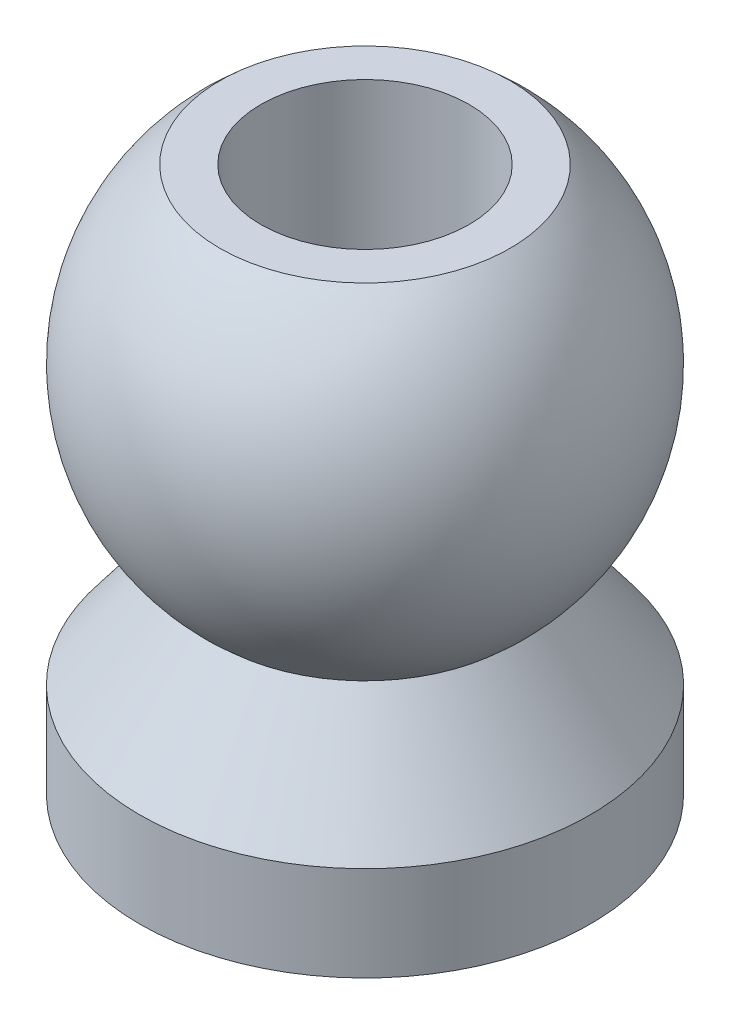
ISO-10303-21;
HEADER;
FILE_DESCRIPTION(('STEP AP214'),'2;1');
FILE_NAME('part.step','',(''),(''),'','','');
FILE_SCHEMA(('AUTOMOTIVE_DESIGN { 1 0 10303 214 1 1 1 1 }'));
ENDSEC;
DATA;
#1=APPLICATION_CONTEXT('core data for automotive mechanical design processes');
#2=APPLICATION_PROTOCOL_DEFINITION('international standard','automotive_design',2000,#1);
#3=PRODUCT_CONTEXT('',#1,'mechanical');
#4=PRODUCT('Part','Part','',(#3));
#5=PRODUCT_RELATED_PRODUCT_CATEGORY('part','',(#4));
#6=PRODUCT_DEFINITION_FORMATION('','',#4);
#7=PRODUCT_DEFINITION_CONTEXT('part definition',#1,'design');
#8=PRODUCT_DEFINITION('design','',#6,#7);
#9=PRODUCT_DEFINITION_SHAPE('','',#8);
#10=(LENGTH_UNIT() NAMED_UNIT(*) SI_UNIT(.MILLI.,.METRE.));
#11=(NAMED_UNIT(*) PLANE_ANGLE_UNIT() SI_UNIT($,.RADIAN.));
#12=(NAMED_UNIT(*) SI_UNIT($,.STERADIAN.) SOLID_ANGLE_UNIT());
#13=UNCERTAINTY_MEASURE_WITH_UNIT(LENGTH_MEASURE(1.E-05),#10,'distance_accuracy_value','');
#14=(GEOMETRIC_REPRESENTATION_CONTEXT(3) GLOBAL_UNCERTAINTY_ASSIGNED_CONTEXT((#13)) GLOBAL_UNIT_ASSIGNED_CONTEXT((#10,
#11,#12)) REPRESENTATION_CONTEXT('',''));
#15=CARTESIAN_POINT('',(0.,0.,0.));
#16=DIRECTION('',(0.,0.,1.));
#17=DIRECTION('',(1.,0.,0.));
#18=AXIS2_PLACEMENT_3D('',#15,#16,#17);
#19=CARTESIAN_POINT('',(0.,1.82,0.));
#20=DIRECTION('',(0.,1.,0.));
#21=DIRECTION('',(0.,0.,1.));
#22=AXIS2_PLACEMENT_3D('',#19,#20,#21);
#23=PLANE('',#22);
#24=CARTESIAN_POINT('',(0.,1.82,0.));
#25=DIRECTION('',(0.,1.,0.));
#26=DIRECTION('',(0.,0.,1.));
#27=AXIS2_PLACEMENT_3D('',#24,#25,#26);
#28=CIRCLE('',#27,1.53362316101446);
#29=CARTESIAN_POINT('',(0.,1.82,1.53362316101446));
#30=VERTEX_POINT('',#29);
#31=EDGE_CURVE('E10',#30,#30,#28,.T.);
#32=ORIENTED_EDGE('',*,*,#31,.T.);
#33=EDGE_LOOP('',(#32));
#34=FACE_BOUND('',#33,.T.);
#35=CARTESIAN_POINT('',(0.,1.82,0.));
#36=DIRECTION('',(0.,1.,0.));
#37=DIRECTION('',(0.,0.,1.));
#38=AXIS2_PLACEMENT_3D('',#35,#36,#37);
#39=CIRCLE('',#38,1.1);
#40=CARTESIAN_POINT('',(0.,1.82,1.1));
#41=VERTEX_POINT('',#40);
#42=EDGE_CURVE('E63',#41,#41,#39,.T.);
#43=ORIENTED_EDGE('',*,*,#42,.F.);
#44=EDGE_LOOP('',(#43));
#45=FACE_BOUND('',#44,.T.);
#46=ADVANCED_FACE('F41',(#34,#45),#23,.T.);
#47=CARTESIAN_POINT('',(0.,0.,0.));
#48=DIRECTION('',(0.,1.,0.));
#49=DIRECTION('',(-1.,0.,0.));
#50=AXIS2_PLACEMENT_3D('',#47,#48,#49);
#51=SPHERICAL_SURFACE('',#50,2.38);
#52=CARTESIAN_POINT('',(0.,-1.82,0.));
#53=DIRECTION('',(0.,1.,0.));
#54=DIRECTION('',(0.,0.,1.));
#55=AXIS2_PLACEMENT_3D('',#52,#53,#54);
#56=CIRCLE('',#55,1.53362316101446);
#57=CARTESIAN_POINT('',(0.,-1.82,1.53362316101446));
#58=VERTEX_POINT('',#57);
#59=EDGE_CURVE('E47',#58,#58,#56,.T.);
#60=ORIENTED_EDGE('',*,*,#59,.T.);
#61=EDGE_LOOP('',(#60));
#62=FACE_BOUND('',#61,.T.);
#63=ORIENTED_EDGE('',*,*,#31,.F.);
#64=EDGE_LOOP('',(#63));
#65=FACE_BOUND('',#64,.T.);
#66=ADVANCED_FACE('F70',(#62,#65),#51,.T.);
#67=CARTESIAN_POINT('',(0.,-2.94,0.));
#68=DIRECTION('',(0.,-1.,0.));
#69=DIRECTION('',(0.,0.,-1.));
#70=AXIS2_PLACEMENT_3D('',#67,#68,#69);
#71=CONICAL_SURFACE('',#70,2.38,0.6471350693814);
#72=ORIENTED_EDGE('',*,*,#59,.F.);
#73=EDGE_LOOP('',(#72));
#74=FACE_BOUND('',#73,.T.);
#75=CARTESIAN_POINT('',(0.,-2.94,0.));
#76=DIRECTION('',(0.,1.,0.));
#77=DIRECTION('',(0.,0.,1.));
#78=AXIS2_PLACEMENT_3D('',#75,#76,#77);
#79=CIRCLE('',#78,2.38);
#80=CARTESIAN_POINT('',(0.,-2.94,2.38));
#81=VERTEX_POINT('',#80);
#82=EDGE_CURVE('E51',#81,#81,#79,.T.);
#83=ORIENTED_EDGE('',*,*,#82,.T.);
#84=EDGE_LOOP('',(#83));
#85=FACE_BOUND('',#84,.T.);
#86=ADVANCED_FACE('F74',(#74,#85),#71,.T.);
#87=CARTESIAN_POINT('',(0.,4.380472835046,0.));
#88=DIRECTION('',(0.,1.,0.));
#89=DIRECTION('',(0.,0.,1.));
#90=AXIS2_PLACEMENT_3D('',#87,#88,#89);
#91=CYLINDRICAL_SURFACE('',#90,2.38);
#92=ORIENTED_EDGE('',*,*,#82,.F.);
#93=EDGE_LOOP('',(#92));
#94=FACE_BOUND('',#93,.T.);
#95=CARTESIAN_POINT('',(0.,-3.94,0.));
#96=DIRECTION('',(0.,1.,0.));
#97=DIRECTION('',(0.,0.,1.));
#98=AXIS2_PLACEMENT_3D('',#95,#96,#97);
#99=CIRCLE('',#98,2.38);
#100=CARTESIAN_POINT('',(0.,-3.94,2.38));
#101=VERTEX_POINT('',#100);
#102=EDGE_CURVE('E55',#101,#101,#99,.T.);
#103=ORIENTED_EDGE('',*,*,#102,.T.);
#104=EDGE_LOOP('',(#103));
#105=FACE_BOUND('',#104,.T.);
#106=ADVANCED_FACE('F78',(#94,#105),#91,.T.);
#107=CARTESIAN_POINT('',(0.,-3.94,0.));
#108=DIRECTION('',(0.,1.,0.));
#109=DIRECTION('',(0.,0.,1.));
#110=AXIS2_PLACEMENT_3D('',#107,#108,#109);
#111=PLANE('',#110);
#112=ORIENTED_EDGE('',*,*,#102,.F.);
#113=EDGE_LOOP('',(#112));
#114=FACE_BOUND('',#113,.T.);
#115=CARTESIAN_POINT('',(0.,-3.94,0.));
#116=DIRECTION('',(0.,1.,0.));
#117=DIRECTION('',(0.,0.,1.));
#118=AXIS2_PLACEMENT_3D('',#115,#116,#117);
#119=CIRCLE('',#118,1.1);
#120=CARTESIAN_POINT('',(0.,-3.94,1.1));
#121=VERTEX_POINT('',#120);
#122=EDGE_CURVE('E60',#121,#121,#119,.T.);
#123=ORIENTED_EDGE('',*,*,#122,.T.);
#124=EDGE_LOOP('',(#123));
#125=FACE_BOUND('',#124,.T.);
#126=ADVANCED_FACE('F85',(#114,#125),#111,.F.);
#127=CARTESIAN_POINT('',(0.,4.380472835046,0.));
#128=DIRECTION('',(0.,1.,0.));
#129=DIRECTION('',(0.,0.,1.));
#130=AXIS2_PLACEMENT_3D('',#127,#128,#129);
#131=CYLINDRICAL_SURFACE('',#130,1.1);
#132=ORIENTED_EDGE('',*,*,#122,.F.);
#133=EDGE_LOOP('',(#132));
#134=FACE_BOUND('',#133,.T.);
#135=ORIENTED_EDGE('',*,*,#42,.T.);
#136=EDGE_LOOP('',(#135));
#137=FACE_BOUND('',#136,.T.);
#138=ADVANCED_FACE('F67',(#134,#137),#131,.F.);
#139=CLOSED_SHELL('',(#46,#66,#86,#106,#126,#138));
#140=MANIFOLD_SOLID_BREP('B2',#139);
#141=ADVANCED_BREP_SHAPE_REPRESENTATION('',(#18,#140),#14);
#142=SHAPE_DEFINITION_REPRESENTATION(#9,#141);
ENDSEC;
END-ISO-10303-21;
